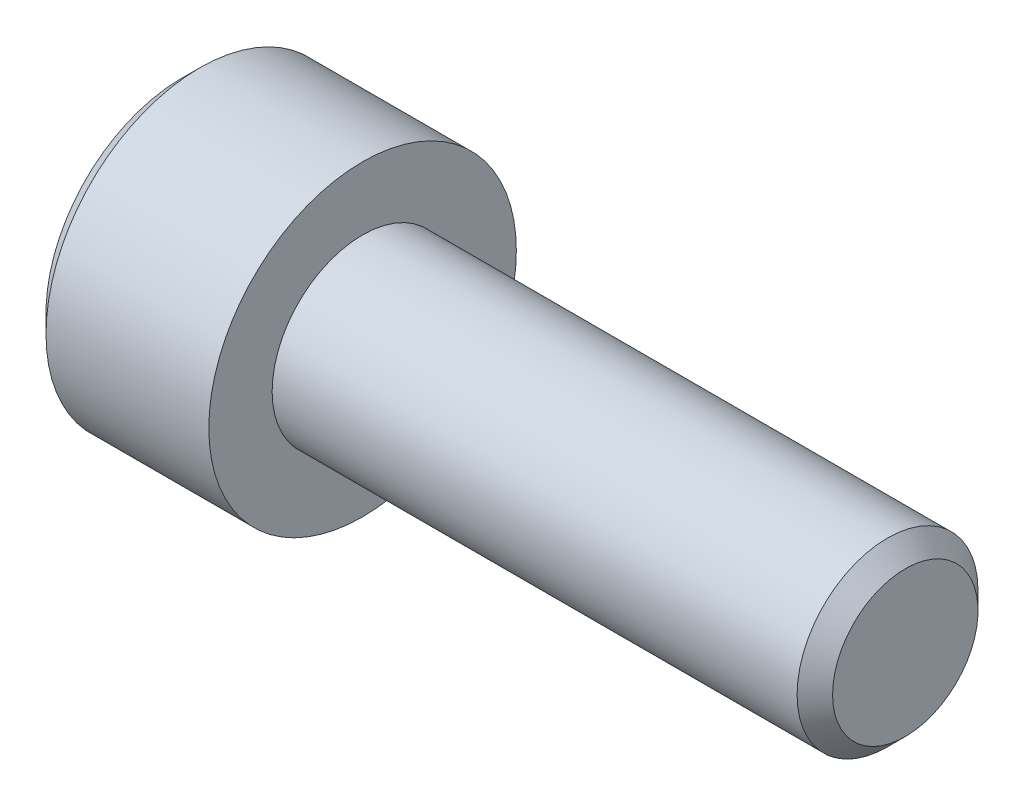
ISO-10303-21;
HEADER;
FILE_DESCRIPTION(('STEP AP214'),'2;1');
FILE_NAME('part.step','',(''),(''),'','','');
FILE_SCHEMA(('AUTOMOTIVE_DESIGN { 1 0 10303 214 1 1 1 1 }'));
ENDSEC;
DATA;
#1=APPLICATION_CONTEXT('core data for automotive mechanical design processes');
#2=APPLICATION_PROTOCOL_DEFINITION('international standard','automotive_design',2000,#1);
#3=PRODUCT_CONTEXT('',#1,'mechanical');
#4=PRODUCT('Part','Part','',(#3));
#5=PRODUCT_RELATED_PRODUCT_CATEGORY('part','',(#4));
#6=PRODUCT_DEFINITION_FORMATION('','',#4);
#7=PRODUCT_DEFINITION_CONTEXT('part definition',#1,'design');
#8=PRODUCT_DEFINITION('design','',#6,#7);
#9=PRODUCT_DEFINITION_SHAPE('','',#8);
#10=(LENGTH_UNIT() NAMED_UNIT(*) SI_UNIT(.MILLI.,.METRE.));
#11=(NAMED_UNIT(*) PLANE_ANGLE_UNIT() SI_UNIT($,.RADIAN.));
#12=(NAMED_UNIT(*) SI_UNIT($,.STERADIAN.) SOLID_ANGLE_UNIT());
#13=UNCERTAINTY_MEASURE_WITH_UNIT(LENGTH_MEASURE(1.E-05),#10,'distance_accuracy_value','');
#14=(GEOMETRIC_REPRESENTATION_CONTEXT(3) GLOBAL_UNCERTAINTY_ASSIGNED_CONTEXT((#13)) GLOBAL_UNIT_ASSIGNED_CONTEXT((#10,
#11,#12)) REPRESENTATION_CONTEXT('',''));
#15=CARTESIAN_POINT('',(0.,0.,0.));
#16=DIRECTION('',(0.,0.,1.));
#17=DIRECTION('',(1.,0.,0.));
#18=AXIS2_PLACEMENT_3D('',#15,#16,#17);
#19=CARTESIAN_POINT('',(-2.5,0.,0.));
#20=DIRECTION('',(1.,0.,0.));
#21=DIRECTION('',(0.,0.,-1.));
#22=AXIS2_PLACEMENT_3D('',#19,#20,#21);
#23=PLANE('',#22);
#24=DIRECTION('',(0.,1.,0.));
#25=VECTOR('',#24,1.);
#26=CARTESIAN_POINT('',(-2.5,0.,2.));
#27=LINE('',#26,#25);
#28=CARTESIAN_POINT('',(-2.5,1.15470053837925,2.));
#29=VERTEX_POINT('',#28);
#30=CARTESIAN_POINT('',(-2.50000000073885,0.,1.9999999997774));
#31=VERTEX_POINT('',#30);
#32=EDGE_CURVE('E104',#29,#31,#27,.F.);
#33=ORIENTED_EDGE('',*,*,#32,.F.);
#34=DIRECTION('',(0.,-0.500000000000003,0.866025403784437));
#35=VECTOR('',#34,1.);
#36=CARTESIAN_POINT('',(-2.5,1.73205080756888,1.));
#37=LINE('',#36,#35);
#38=CARTESIAN_POINT('',(-2.50000000073885,1.7320508073761,0.9999999998887));
#39=VERTEX_POINT('',#38);
#40=EDGE_CURVE('E91',#39,#29,#37,.T.);
#41=ORIENTED_EDGE('',*,*,#40,.F.);
#42=CARTESIAN_POINT('',(-2.5000000014777,0.,0.));
#43=DIRECTION('',(-1.,0.,0.));
#44=DIRECTION('',(0.,0.,1.));
#45=AXIS2_PLACEMENT_3D('',#42,#43,#44);
#46=CIRCLE('',#45,1.9999999995548);
#47=EDGE_CURVE('E20',#39,#31,#46,.F.);
#48=ORIENTED_EDGE('',*,*,#47,.T.);
#49=EDGE_LOOP('',(#33,#41,#48));
#50=FACE_BOUND('',#49,.T.);
#51=ADVANCED_FACE('F17',(#50),#23,.F.);
#52=CARTESIAN_POINT('',(-2.5,0.,0.));
#53=DIRECTION('',(1.,0.,0.));
#54=DIRECTION('',(0.,0.,-1.));
#55=AXIS2_PLACEMENT_3D('',#52,#53,#54);
#56=PLANE('',#55);
#57=DIRECTION('',(0.,0.499999999999996,-0.866025403784441));
#58=VECTOR('',#57,1.);
#59=CARTESIAN_POINT('',(-2.5,-2.3094010767585,0.));
#60=LINE('',#59,#58);
#61=CARTESIAN_POINT('',(-2.5,-2.3094010767585,0.));
#62=VERTEX_POINT('',#61);
#63=CARTESIAN_POINT('',(-2.50000000073885,-1.7320508073761,-0.9999999998887));
#64=VERTEX_POINT('',#63);
#65=EDGE_CURVE('E174',#62,#64,#60,.T.);
#66=ORIENTED_EDGE('',*,*,#65,.F.);
#67=DIRECTION('',(0.,-0.499999999999996,-0.866025403784441));
#68=VECTOR('',#67,1.);
#69=CARTESIAN_POINT('',(-2.5,-1.73205080756888,1.));
#70=LINE('',#69,#68);
#71=CARTESIAN_POINT('',(-2.50000000073885,-1.7320508073761,0.9999999998887));
#72=VERTEX_POINT('',#71);
#73=EDGE_CURVE('E170',#72,#62,#70,.T.);
#74=ORIENTED_EDGE('',*,*,#73,.F.);
#75=CARTESIAN_POINT('',(-2.5000000014777,0.,0.));
#76=DIRECTION('',(-1.,0.,0.));
#77=DIRECTION('',(0.,0.,1.));
#78=AXIS2_PLACEMENT_3D('',#75,#76,#77);
#79=CIRCLE('',#78,1.9999999995548);
#80=EDGE_CURVE('E118',#72,#64,#79,.F.);
#81=ORIENTED_EDGE('',*,*,#80,.T.);
#82=EDGE_LOOP('',(#66,#74,#81));
#83=FACE_BOUND('',#82,.T.);
#84=ADVANCED_FACE('F407',(#83),#56,.F.);
#85=CARTESIAN_POINT('',(-2.5,0.,0.));
#86=DIRECTION('',(1.,0.,0.));
#87=DIRECTION('',(0.,0.,-1.));
#88=AXIS2_PLACEMENT_3D('',#85,#86,#87);
#89=PLANE('',#88);
#90=DIRECTION('',(0.,1.,0.));
#91=VECTOR('',#90,1.);
#92=CARTESIAN_POINT('',(-2.5,0.,-2.));
#93=LINE('',#92,#91);
#94=CARTESIAN_POINT('',(-2.5,-1.15470053837925,-2.));
#95=VERTEX_POINT('',#94);
#96=CARTESIAN_POINT('',(-2.50000000073885,0.,-1.9999999997774));
#97=VERTEX_POINT('',#96);
#98=EDGE_CURVE('E182',#95,#97,#93,.T.);
#99=ORIENTED_EDGE('',*,*,#98,.F.);
#100=DIRECTION('',(0.,0.500000000000003,-0.866025403784437));
#101=VECTOR('',#100,1.);
#102=CARTESIAN_POINT('',(-2.5,-1.73205080756888,-1.));
#103=LINE('',#102,#101);
#104=EDGE_CURVE('E178',#64,#95,#103,.T.);
#105=ORIENTED_EDGE('',*,*,#104,.F.);
#106=CARTESIAN_POINT('',(-2.5000000014777,0.,0.));
#107=DIRECTION('',(-1.,0.,0.));
#108=DIRECTION('',(0.,0.,1.));
#109=AXIS2_PLACEMENT_3D('',#106,#107,#108);
#110=CIRCLE('',#109,1.9999999995548);
#111=EDGE_CURVE('E120',#64,#97,#110,.F.);
#112=ORIENTED_EDGE('',*,*,#111,.T.);
#113=EDGE_LOOP('',(#99,#105,#112));
#114=FACE_BOUND('',#113,.T.);
#115=ADVANCED_FACE('F398',(#114),#89,.F.);
#116=CARTESIAN_POINT('',(-2.5,0.,0.));
#117=DIRECTION('',(1.,0.,0.));
#118=DIRECTION('',(0.,0.,-1.));
#119=AXIS2_PLACEMENT_3D('',#116,#117,#118);
#120=PLANE('',#119);
#121=DIRECTION('',(0.,0.500000000000003,0.866025403784437));
#122=VECTOR('',#121,1.);
#123=CARTESIAN_POINT('',(-2.5,1.15470053837925,-2.));
#124=LINE('',#123,#122);
#125=CARTESIAN_POINT('',(-2.5,1.15470053837925,-2.));
#126=VERTEX_POINT('',#125);
#127=CARTESIAN_POINT('',(-2.50000000073885,1.7320508073761,-0.9999999998887));
#128=VERTEX_POINT('',#127);
#129=EDGE_CURVE('E190',#126,#128,#124,.T.);
#130=ORIENTED_EDGE('',*,*,#129,.F.);
#131=DIRECTION('',(0.,1.,0.));
#132=VECTOR('',#131,1.);
#133=CARTESIAN_POINT('',(-2.5,0.,-2.));
#134=LINE('',#133,#132);
#135=EDGE_CURVE('E186',#97,#126,#134,.T.);
#136=ORIENTED_EDGE('',*,*,#135,.F.);
#137=CARTESIAN_POINT('',(-2.5000000014777,0.,0.));
#138=DIRECTION('',(-1.,0.,0.));
#139=DIRECTION('',(0.,0.,1.));
#140=AXIS2_PLACEMENT_3D('',#137,#138,#139);
#141=CIRCLE('',#140,1.9999999995548);
#142=EDGE_CURVE('E112',#97,#128,#141,.F.);
#143=ORIENTED_EDGE('',*,*,#142,.T.);
#144=EDGE_LOOP('',(#130,#136,#143));
#145=FACE_BOUND('',#144,.T.);
#146=ADVANCED_FACE('F390',(#145),#120,.F.);
#147=CARTESIAN_POINT('',(-2.5,0.,0.));
#148=DIRECTION('',(1.,0.,0.));
#149=DIRECTION('',(0.,0.,-1.));
#150=AXIS2_PLACEMENT_3D('',#147,#148,#149);
#151=PLANE('',#150);
#152=DIRECTION('',(0.,-0.499999999999996,0.866025403784441));
#153=VECTOR('',#152,1.);
#154=CARTESIAN_POINT('',(-2.5,2.3094010767585,0.));
#155=LINE('',#154,#153);
#156=CARTESIAN_POINT('',(-2.5,2.3094010767585,0.));
#157=VERTEX_POINT('',#156);
#158=EDGE_CURVE('E87',#157,#39,#155,.T.);
#159=ORIENTED_EDGE('',*,*,#158,.F.);
#160=DIRECTION('',(0.,0.499999999999996,0.866025403784441));
#161=VECTOR('',#160,1.);
#162=CARTESIAN_POINT('',(-2.5,1.73205080756888,-1.));
#163=LINE('',#162,#161);
#164=EDGE_CURVE('E96',#128,#157,#163,.T.);
#165=ORIENTED_EDGE('',*,*,#164,.F.);
#166=CARTESIAN_POINT('',(-2.5000000014777,0.,0.));
#167=DIRECTION('',(-1.,0.,0.));
#168=DIRECTION('',(0.,0.,1.));
#169=AXIS2_PLACEMENT_3D('',#166,#167,#168);
#170=CIRCLE('',#169,1.9999999995548);
#171=EDGE_CURVE('E107',#128,#39,#170,.F.);
#172=ORIENTED_EDGE('',*,*,#171,.T.);
#173=EDGE_LOOP('',(#159,#165,#172));
#174=FACE_BOUND('',#173,.T.);
#175=ADVANCED_FACE('F108',(#174),#151,.F.);
#176=CARTESIAN_POINT('',(-2.50000000144723,0.,0.));
#177=DIRECTION('',(-1.,0.,0.));
#178=DIRECTION('',(0.,0.,1.));
#179=AXIS2_PLACEMENT_3D('',#176,#177,#178);
#180=CONICAL_SURFACE('',#179,1.99999999944112,1.30899693745666);
#181=CARTESIAN_POINT('',(-1.96410161350968,-5.6843418860808E-11,0.));
#182=VERTEX_POINT('',#181);
#183=VERTEX_LOOP('',#182);
#184=FACE_BOUND('',#183,.T.);
#185=ORIENTED_EDGE('',*,*,#142,.F.);
#186=ORIENTED_EDGE('',*,*,#111,.F.);
#187=ORIENTED_EDGE('',*,*,#80,.F.);
#188=CARTESIAN_POINT('',(-2.5000000014777,0.,0.));
#189=DIRECTION('',(-1.,0.,0.));
#190=DIRECTION('',(0.,0.,1.));
#191=AXIS2_PLACEMENT_3D('',#188,#189,#190);
#192=CIRCLE('',#191,1.9999999995548);
#193=EDGE_CURVE('E111',#72,#31,#192,.T.);
#194=ORIENTED_EDGE('',*,*,#193,.T.);
#195=ORIENTED_EDGE('',*,*,#47,.F.);
#196=ORIENTED_EDGE('',*,*,#171,.F.);
#197=EDGE_LOOP('',(#185,#186,#187,#194,#195,#196));
#198=FACE_BOUND('',#197,.T.);
#199=ADVANCED_FACE('F114',(#184,#198),#180,.F.);
#200=CARTESIAN_POINT('',(-2.5,0.,0.));
#201=DIRECTION('',(1.,0.,0.));
#202=DIRECTION('',(0.,0.,-1.));
#203=AXIS2_PLACEMENT_3D('',#200,#201,#202);
#204=PLANE('',#203);
#205=DIRECTION('',(0.,-0.5,-0.866025403784439));
#206=VECTOR('',#205,1.);
#207=CARTESIAN_POINT('',(-2.5,-2.3094010767585,0.));
#208=LINE('',#207,#206);
#209=CARTESIAN_POINT('',(-2.5,-1.15470053837925,2.));
#210=VERTEX_POINT('',#209);
#211=EDGE_CURVE('E202',#72,#210,#208,.F.);
#212=ORIENTED_EDGE('',*,*,#211,.T.);
#213=DIRECTION('',(0.,1.,0.));
#214=VECTOR('',#213,1.);
#215=CARTESIAN_POINT('',(-2.5,-1.15470053837925,2.));
#216=LINE('',#215,#214);
#217=EDGE_CURVE('E130',#210,#31,#216,.T.);
#218=ORIENTED_EDGE('',*,*,#217,.T.);
#219=ORIENTED_EDGE('',*,*,#193,.F.);
#220=EDGE_LOOP('',(#212,#218,#219));
#221=FACE_BOUND('',#220,.T.);
#222=ADVANCED_FACE('F365',(#221),#204,.F.);
#223=CARTESIAN_POINT('',(-5.,-1.15470053837925,2.));
#224=DIRECTION('',(0.,0.,1.));
#225=DIRECTION('',(1.,0.,0.));
#226=AXIS2_PLACEMENT_3D('',#223,#224,#225);
#227=PLANE('',#226);
#228=DIRECTION('',(1.,0.,0.));
#229=VECTOR('',#228,1.);
#230=CARTESIAN_POINT('',(-5.,1.15470053837925,2.));
#231=LINE('',#230,#229);
#232=CARTESIAN_POINT('',(-5.,1.15470053837925,2.));
#233=VERTEX_POINT('',#232);
#234=EDGE_CURVE('E146',#233,#29,#231,.T.);
#235=ORIENTED_EDGE('',*,*,#234,.T.);
#236=ORIENTED_EDGE('',*,*,#32,.T.);
#237=ORIENTED_EDGE('',*,*,#217,.F.);
#238=DIRECTION('',(1.,0.,0.));
#239=VECTOR('',#238,1.);
#240=CARTESIAN_POINT('',(-5.,-1.15470053837925,2.));
#241=LINE('',#240,#239);
#242=CARTESIAN_POINT('',(-5.,-1.15470053837925,2.));
#243=VERTEX_POINT('',#242);
#244=EDGE_CURVE('E154',#210,#243,#241,.F.);
#245=ORIENTED_EDGE('',*,*,#244,.T.);
#246=DIRECTION('',(0.,1.,0.));
#247=VECTOR('',#246,1.);
#248=CARTESIAN_POINT('',(-5.,1.875,2.));
#249=LINE('',#248,#247);
#250=EDGE_CURVE('E164',#233,#243,#249,.F.);
#251=ORIENTED_EDGE('',*,*,#250,.F.);
#252=EDGE_LOOP('',(#235,#236,#237,#245,#251));
#253=FACE_BOUND('',#252,.T.);
#254=ADVANCED_FACE('F356',(#253),#227,.F.);
#255=CARTESIAN_POINT('',(-5.,-2.3094010767585,0.));
#256=DIRECTION('',(0.,-0.866025403784439,0.5));
#257=DIRECTION('',(0.,-0.5,-0.866025403784439));
#258=AXIS2_PLACEMENT_3D('',#255,#256,#257);
#259=PLANE('',#258);
#260=ORIENTED_EDGE('',*,*,#244,.F.);
#261=ORIENTED_EDGE('',*,*,#211,.F.);
#262=ORIENTED_EDGE('',*,*,#73,.T.);
#263=DIRECTION('',(1.,0.,0.));
#264=VECTOR('',#263,1.);
#265=CARTESIAN_POINT('',(-5.,-2.3094010767585,0.));
#266=LINE('',#265,#264);
#267=CARTESIAN_POINT('',(-5.,-2.3094010767585,0.));
#268=VERTEX_POINT('',#267);
#269=EDGE_CURVE('E151',#62,#268,#266,.F.);
#270=ORIENTED_EDGE('',*,*,#269,.T.);
#271=DIRECTION('',(0.,-0.499999999999999,-0.866025403784439));
#272=VECTOR('',#271,1.);
#273=CARTESIAN_POINT('',(-5.,-1.15470053837925,2.));
#274=LINE('',#273,#272);
#275=EDGE_CURVE('E211',#243,#268,#274,.T.);
#276=ORIENTED_EDGE('',*,*,#275,.F.);
#277=EDGE_LOOP('',(#260,#261,#262,#270,#276));
#278=FACE_BOUND('',#277,.T.);
#279=ADVANCED_FACE('F347',(#278),#259,.F.);
#280=CARTESIAN_POINT('',(-5.,-1.15470053837925,-2.));
#281=DIRECTION('',(0.,-0.866025403784439,-0.5));
#282=DIRECTION('',(0.,0.5,-0.866025403784439));
#283=AXIS2_PLACEMENT_3D('',#280,#281,#282);
#284=PLANE('',#283);
#285=ORIENTED_EDGE('',*,*,#269,.F.);
#286=ORIENTED_EDGE('',*,*,#65,.T.);
#287=ORIENTED_EDGE('',*,*,#104,.T.);
#288=DIRECTION('',(-1.,0.,0.));
#289=VECTOR('',#288,1.);
#290=CARTESIAN_POINT('',(-5.,-1.15470053837925,-2.));
#291=LINE('',#290,#289);
#292=CARTESIAN_POINT('',(-5.,-1.15470053837925,-2.));
#293=VERTEX_POINT('',#292);
#294=EDGE_CURVE('E153',#95,#293,#291,.T.);
#295=ORIENTED_EDGE('',*,*,#294,.T.);
#296=DIRECTION('',(0.,0.499999999999999,-0.866025403784439));
#297=VECTOR('',#296,1.);
#298=CARTESIAN_POINT('',(-5.,-2.3094010767585,0.));
#299=LINE('',#298,#297);
#300=EDGE_CURVE('E214',#268,#293,#299,.T.);
#301=ORIENTED_EDGE('',*,*,#300,.F.);
#302=EDGE_LOOP('',(#285,#286,#287,#295,#301));
#303=FACE_BOUND('',#302,.T.);
#304=ADVANCED_FACE('F338',(#303),#284,.F.);
#305=CARTESIAN_POINT('',(-5.,1.15470053837925,-2.));
#306=DIRECTION('',(0.,0.,-1.));
#307=DIRECTION('',(-1.,0.,0.));
#308=AXIS2_PLACEMENT_3D('',#305,#306,#307);
#309=PLANE('',#308);
#310=ORIENTED_EDGE('',*,*,#294,.F.);
#311=ORIENTED_EDGE('',*,*,#98,.T.);
#312=ORIENTED_EDGE('',*,*,#135,.T.);
#313=DIRECTION('',(1.,0.,0.));
#314=VECTOR('',#313,1.);
#315=CARTESIAN_POINT('',(-5.,1.15470053837925,-2.));
#316=LINE('',#315,#314);
#317=CARTESIAN_POINT('',(-5.,1.15470053837925,-2.));
#318=VERTEX_POINT('',#317);
#319=EDGE_CURVE('E148',#126,#318,#316,.F.);
#320=ORIENTED_EDGE('',*,*,#319,.T.);
#321=DIRECTION('',(0.,1.,0.));
#322=VECTOR('',#321,1.);
#323=CARTESIAN_POINT('',(-5.,1.875,-2.));
#324=LINE('',#323,#322);
#325=EDGE_CURVE('E217',#293,#318,#324,.T.);
#326=ORIENTED_EDGE('',*,*,#325,.F.);
#327=EDGE_LOOP('',(#310,#311,#312,#320,#326));
#328=FACE_BOUND('',#327,.T.);
#329=ADVANCED_FACE('F330',(#328),#309,.F.);
#330=CARTESIAN_POINT('',(-5.,2.3094010767585,0.));
#331=DIRECTION('',(0.,0.866025403784439,-0.5));
#332=DIRECTION('',(0.,0.5,0.866025403784439));
#333=AXIS2_PLACEMENT_3D('',#330,#331,#332);
#334=PLANE('',#333);
#335=ORIENTED_EDGE('',*,*,#319,.F.);
#336=ORIENTED_EDGE('',*,*,#129,.T.);
#337=ORIENTED_EDGE('',*,*,#164,.T.);
#338=DIRECTION('',(1.,0.,0.));
#339=VECTOR('',#338,1.);
#340=CARTESIAN_POINT('',(-5.,2.3094010767585,0.));
#341=LINE('',#340,#339);
#342=CARTESIAN_POINT('',(-5.,2.3094010767585,0.));
#343=VERTEX_POINT('',#342);
#344=EDGE_CURVE('E35',#157,#343,#341,.F.);
#345=ORIENTED_EDGE('',*,*,#344,.T.);
#346=DIRECTION('',(0.,0.499999999999999,0.866025403784439));
#347=VECTOR('',#346,1.);
#348=CARTESIAN_POINT('',(-5.,1.15470053837925,-2.));
#349=LINE('',#348,#347);
#350=EDGE_CURVE('E220',#318,#343,#349,.T.);
#351=ORIENTED_EDGE('',*,*,#350,.F.);
#352=EDGE_LOOP('',(#335,#336,#337,#345,#351));
#353=FACE_BOUND('',#352,.T.);
#354=ADVANCED_FACE('F248',(#353),#334,.F.);
#355=CARTESIAN_POINT('',(-5.,1.15470053837925,2.));
#356=DIRECTION('',(0.,0.866025403784439,0.5));
#357=DIRECTION('',(0.,-0.5,0.866025403784439));
#358=AXIS2_PLACEMENT_3D('',#355,#356,#357);
#359=PLANE('',#358);
#360=ORIENTED_EDGE('',*,*,#344,.F.);
#361=ORIENTED_EDGE('',*,*,#158,.T.);
#362=ORIENTED_EDGE('',*,*,#40,.T.);
#363=ORIENTED_EDGE('',*,*,#234,.F.);
#364=DIRECTION('',(0.,-0.499999999999999,0.866025403784439));
#365=VECTOR('',#364,1.);
#366=CARTESIAN_POINT('',(-5.,2.3094010767585,0.));
#367=LINE('',#366,#365);
#368=EDGE_CURVE('E135',#343,#233,#367,.T.);
#369=ORIENTED_EDGE('',*,*,#368,.F.);
#370=EDGE_LOOP('',(#360,#361,#362,#363,#369));
#371=FACE_BOUND('',#370,.T.);
#372=ADVANCED_FACE('F89',(#371),#359,.F.);
#373=CARTESIAN_POINT('',(-5.,1.875,0.));
#374=DIRECTION('',(-1.,0.,0.));
#375=DIRECTION('',(0.,0.,1.));
#376=AXIS2_PLACEMENT_3D('',#373,#374,#375);
#377=PLANE('',#376);
#378=ORIENTED_EDGE('',*,*,#350,.T.);
#379=ORIENTED_EDGE('',*,*,#368,.T.);
#380=ORIENTED_EDGE('',*,*,#250,.T.);
#381=ORIENTED_EDGE('',*,*,#275,.T.);
#382=ORIENTED_EDGE('',*,*,#300,.T.);
#383=ORIENTED_EDGE('',*,*,#325,.T.);
#384=EDGE_LOOP('',(#378,#379,#380,#381,#382,#383));
#385=FACE_BOUND('',#384,.T.);
#386=CARTESIAN_POINT('',(-5.00000000022283,0.,0.));
#387=DIRECTION('',(1.,0.,0.));
#388=DIRECTION('',(0.,0.,-1.));
#389=AXIS2_PLACEMENT_3D('',#386,#387,#388);
#390=CIRCLE('',#389,3.75000000019554);
#391=CARTESIAN_POINT('',(-5.00000000022283,0.,-3.75000000019554));
#392=VERTEX_POINT('',#391);
#393=EDGE_CURVE('E131',#392,#392,#390,.T.);
#394=ORIENTED_EDGE('',*,*,#393,.F.);
#395=EDGE_LOOP('',(#394));
#396=FACE_BOUND('',#395,.T.);
#397=ADVANCED_FACE('F237',(#385,#396),#377,.T.);
#398=CARTESIAN_POINT('',(-4.49999999983675,0.,0.));
#399=DIRECTION('',(1.,0.,0.));
#400=DIRECTION('',(0.,0.,-1.));
#401=AXIS2_PLACEMENT_3D('',#398,#399,#400);
#402=CONICAL_SURFACE('',#401,4.24999999972897,0.785398162544797);
#403=CARTESIAN_POINT('',(-4.5,0.,0.));
#404=DIRECTION('',(1.,0.,0.));
#405=DIRECTION('',(0.,0.,-1.));
#406=AXIS2_PLACEMENT_3D('',#403,#404,#405);
#407=CIRCLE('',#406,4.25);
#408=CARTESIAN_POINT('',(-4.5,0.,-4.25));
#409=VERTEX_POINT('',#408);
#410=EDGE_CURVE('E134',#409,#409,#407,.T.);
#411=ORIENTED_EDGE('',*,*,#410,.F.);
#412=EDGE_LOOP('',(#411));
#413=FACE_BOUND('',#412,.T.);
#414=ORIENTED_EDGE('',*,*,#393,.T.);
#415=EDGE_LOOP('',(#414));
#416=FACE_BOUND('',#415,.T.);
#417=ADVANCED_FACE('F234',(#413,#416),#402,.T.);
#418=CARTESIAN_POINT('',(-2.25,0.,0.));
#419=DIRECTION('',(1.,0.,0.));
#420=DIRECTION('',(0.,0.,-1.));
#421=AXIS2_PLACEMENT_3D('',#418,#419,#420);
#422=CYLINDRICAL_SURFACE('',#421,4.25);
#423=CARTESIAN_POINT('',(0.,0.,0.));
#424=DIRECTION('',(1.,0.,0.));
#425=DIRECTION('',(0.,0.,-1.));
#426=AXIS2_PLACEMENT_3D('',#423,#424,#425);
#427=CIRCLE('',#426,4.25);
#428=CARTESIAN_POINT('',(0.,0.,-4.25));
#429=VERTEX_POINT('',#428);
#430=EDGE_CURVE('E136',#429,#429,#427,.T.);
#431=ORIENTED_EDGE('',*,*,#430,.F.);
#432=EDGE_LOOP('',(#431));
#433=FACE_BOUND('',#432,.T.);
#434=ORIENTED_EDGE('',*,*,#410,.T.);
#435=EDGE_LOOP('',(#434));
#436=FACE_BOUND('',#435,.T.);
#437=ADVANCED_FACE('F232',(#433,#436),#422,.T.);
#438=CARTESIAN_POINT('',(15.,1.00475,0.));
#439=DIRECTION('',(1.,0.,0.));
#440=DIRECTION('',(0.,0.,-1.));
#441=AXIS2_PLACEMENT_3D('',#438,#439,#440);
#442=PLANE('',#441);
#443=CARTESIAN_POINT('',(15.0000000002706,0.,0.));
#444=DIRECTION('',(-1.,0.,0.));
#445=DIRECTION('',(0.,0.,1.));
#446=AXIS2_PLACEMENT_3D('',#443,#444,#445);
#447=CIRCLE('',#446,2.00950000021294);
#448=CARTESIAN_POINT('',(15.0000000002706,0.,2.00950000021294));
#449=VERTEX_POINT('',#448);
#450=EDGE_CURVE('E139',#449,#449,#447,.T.);
#451=ORIENTED_EDGE('',*,*,#450,.F.);
#452=EDGE_LOOP('',(#451));
#453=FACE_BOUND('',#452,.T.);
#454=ADVANCED_FACE('F265',(#453),#442,.T.);
#455=CARTESIAN_POINT('',(0.,3.375,0.));
#456=DIRECTION('',(1.,0.,0.));
#457=DIRECTION('',(0.,0.,-1.));
#458=AXIS2_PLACEMENT_3D('',#455,#456,#457);
#459=PLANE('',#458);
#460=CARTESIAN_POINT('',(0.,0.,0.));
#461=DIRECTION('',(1.,0.,0.));
#462=DIRECTION('',(0.,0.,-1.));
#463=AXIS2_PLACEMENT_3D('',#460,#461,#462);
#464=CIRCLE('',#463,2.5);
#465=CARTESIAN_POINT('',(0.,0.,-2.5));
#466=VERTEX_POINT('',#465);
#467=EDGE_CURVE('E26',#466,#466,#464,.T.);
#468=ORIENTED_EDGE('',*,*,#467,.F.);
#469=EDGE_LOOP('',(#468));
#470=FACE_BOUND('',#469,.T.);
#471=ORIENTED_EDGE('',*,*,#430,.T.);
#472=EDGE_LOOP('',(#471));
#473=FACE_BOUND('',#472,.T.);
#474=ADVANCED_FACE('F258',(#470,#473),#459,.T.);
#475=CARTESIAN_POINT('',(14.5094999998605,0.,0.));
#476=DIRECTION('',(-1.,0.,0.));
#477=DIRECTION('',(0.,0.,1.));
#478=AXIS2_PLACEMENT_3D('',#475,#476,#477);
#479=CONICAL_SURFACE('',#478,2.49999999971351,0.785398162470339);
#480=ORIENTED_EDGE('',*,*,#450,.T.);
#481=EDGE_LOOP('',(#480));
#482=FACE_BOUND('',#481,.T.);
#483=CARTESIAN_POINT('',(14.5095,0.,0.));
#484=DIRECTION('',(1.,0.,0.));
#485=DIRECTION('',(0.,0.,-1.));
#486=AXIS2_PLACEMENT_3D('',#483,#484,#485);
#487=CIRCLE('',#486,2.5);
#488=CARTESIAN_POINT('',(14.5095,0.,-2.5));
#489=VERTEX_POINT('',#488);
#490=EDGE_CURVE('E11',#489,#489,#487,.F.);
#491=ORIENTED_EDGE('',*,*,#490,.F.);
#492=EDGE_LOOP('',(#491));
#493=FACE_BOUND('',#492,.T.);
#494=ADVANCED_FACE('F252',(#482,#493),#479,.T.);
#495=CARTESIAN_POINT('',(7.25475,0.,0.));
#496=DIRECTION('',(1.,0.,0.));
#497=DIRECTION('',(0.,0.,-1.));
#498=AXIS2_PLACEMENT_3D('',#495,#496,#497);
#499=CYLINDRICAL_SURFACE('',#498,2.5);
#500=ORIENTED_EDGE('',*,*,#490,.T.);
#501=EDGE_LOOP('',(#500));
#502=FACE_BOUND('',#501,.T.);
#503=ORIENTED_EDGE('',*,*,#467,.T.);
#504=EDGE_LOOP('',(#503));
#505=FACE_BOUND('',#504,.T.);
#506=ADVANCED_FACE('F250',(#502,#505),#499,.T.);
#507=CLOSED_SHELL('',(#51,#84,#115,#146,#175,#199,#222,#254,#279,#304,#329,#354,#372,#397,#417,
#437,#454,#474,#494,#506));
#508=MANIFOLD_SOLID_BREP('B1',#507);
#509=ADVANCED_BREP_SHAPE_REPRESENTATION('',(#18,#508),#14);
#510=SHAPE_DEFINITION_REPRESENTATION(#9,#509);
ENDSEC;
END-ISO-10303-21;
